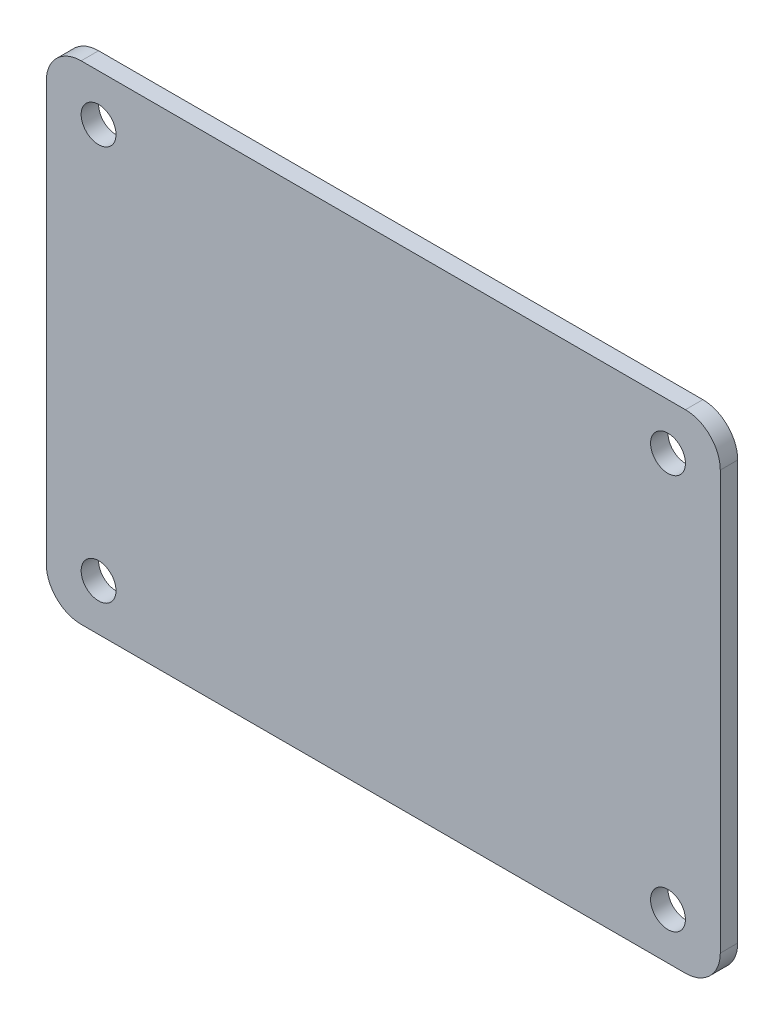
ISO-10303-21;
HEADER;
FILE_DESCRIPTION(('STEP AP214'),'2;1');
FILE_NAME('part.step','',(''),(''),'','','');
FILE_SCHEMA(('AUTOMOTIVE_DESIGN { 1 0 10303 214 1 1 1 1 }'));
ENDSEC;
DATA;
#1=APPLICATION_CONTEXT('core data for automotive mechanical design processes');
#2=APPLICATION_PROTOCOL_DEFINITION('international standard','automotive_design',2000,#1);
#3=PRODUCT_CONTEXT('',#1,'mechanical');
#4=PRODUCT('Part','Part','',(#3));
#5=PRODUCT_RELATED_PRODUCT_CATEGORY('part','',(#4));
#6=PRODUCT_DEFINITION_FORMATION('','',#4);
#7=PRODUCT_DEFINITION_CONTEXT('part definition',#1,'design');
#8=PRODUCT_DEFINITION('design','',#6,#7);
#9=PRODUCT_DEFINITION_SHAPE('','',#8);
#10=(LENGTH_UNIT() NAMED_UNIT(*) SI_UNIT(.MILLI.,.METRE.));
#11=(NAMED_UNIT(*) PLANE_ANGLE_UNIT() SI_UNIT($,.RADIAN.));
#12=(NAMED_UNIT(*) SI_UNIT($,.STERADIAN.) SOLID_ANGLE_UNIT());
#13=UNCERTAINTY_MEASURE_WITH_UNIT(LENGTH_MEASURE(1.E-05),#10,'distance_accuracy_value','');
#14=(GEOMETRIC_REPRESENTATION_CONTEXT(3) GLOBAL_UNCERTAINTY_ASSIGNED_CONTEXT((#13)) GLOBAL_UNIT_ASSIGNED_CONTEXT((#10,
#11,#12)) REPRESENTATION_CONTEXT('',''));
#15=CARTESIAN_POINT('',(0.,0.,0.));
#16=DIRECTION('',(0.,0.,1.));
#17=DIRECTION('',(1.,0.,0.));
#18=AXIS2_PLACEMENT_3D('',#15,#16,#17);
#19=CARTESIAN_POINT('',(29.,21.,1.5));
#20=DIRECTION('',(-1.,0.,0.));
#21=DIRECTION('',(0.,-1.,0.));
#22=AXIS2_PLACEMENT_3D('',#19,#20,#21);
#23=PLANE('',#22);
#24=DIRECTION('',(0.,1.,0.));
#25=VECTOR('',#24,1.);
#26=CARTESIAN_POINT('',(29.,21.,0.));
#27=LINE('',#26,#25);
#28=CARTESIAN_POINT('',(29.,-18.,0.));
#29=VERTEX_POINT('',#28);
#30=CARTESIAN_POINT('',(29.,18.,0.));
#31=VERTEX_POINT('',#30);
#32=EDGE_CURVE('E127',#29,#31,#27,.T.);
#33=ORIENTED_EDGE('',*,*,#32,.T.);
#34=DIRECTION('',(0.,0.,-1.));
#35=VECTOR('',#34,1.);
#36=CARTESIAN_POINT('',(29.,18.,1.5));
#37=LINE('',#36,#35);
#38=CARTESIAN_POINT('',(29.,18.,1.5));
#39=VERTEX_POINT('',#38);
#40=EDGE_CURVE('E105',#31,#39,#37,.F.);
#41=ORIENTED_EDGE('',*,*,#40,.T.);
#42=DIRECTION('',(0.,1.,0.));
#43=VECTOR('',#42,1.);
#44=CARTESIAN_POINT('',(29.,21.,1.5));
#45=LINE('',#44,#43);
#46=CARTESIAN_POINT('',(29.,-18.,1.5));
#47=VERTEX_POINT('',#46);
#48=EDGE_CURVE('E137',#47,#39,#45,.T.);
#49=ORIENTED_EDGE('',*,*,#48,.F.);
#50=DIRECTION('',(0.,0.,-1.));
#51=VECTOR('',#50,1.);
#52=CARTESIAN_POINT('',(29.,-18.,1.5));
#53=LINE('',#52,#51);
#54=EDGE_CURVE('E110',#47,#29,#53,.T.);
#55=ORIENTED_EDGE('',*,*,#54,.T.);
#56=EDGE_LOOP('',(#33,#41,#49,#55));
#57=FACE_BOUND('',#56,.T.);
#58=ADVANCED_FACE('F34',(#57),#23,.F.);
#59=CARTESIAN_POINT('',(-29.,21.,1.5));
#60=DIRECTION('',(0.,-1.,0.));
#61=DIRECTION('',(0.,0.,-1.));
#62=AXIS2_PLACEMENT_3D('',#59,#60,#61);
#63=PLANE('',#62);
#64=DIRECTION('',(-1.,0.,0.));
#65=VECTOR('',#64,1.);
#66=CARTESIAN_POINT('',(-29.,21.,1.5));
#67=LINE('',#66,#65);
#68=CARTESIAN_POINT('',(26.,21.,1.5));
#69=VERTEX_POINT('',#68);
#70=CARTESIAN_POINT('',(-26.,21.,1.5));
#71=VERTEX_POINT('',#70);
#72=EDGE_CURVE('E120',#69,#71,#67,.T.);
#73=ORIENTED_EDGE('',*,*,#72,.F.);
#74=DIRECTION('',(0.,0.,-1.));
#75=VECTOR('',#74,1.);
#76=CARTESIAN_POINT('',(26.,21.,1.5));
#77=LINE('',#76,#75);
#78=CARTESIAN_POINT('',(26.,21.,0.));
#79=VERTEX_POINT('',#78);
#80=EDGE_CURVE('E104',#69,#79,#77,.T.);
#81=ORIENTED_EDGE('',*,*,#80,.T.);
#82=DIRECTION('',(-1.,0.,0.));
#83=VECTOR('',#82,1.);
#84=CARTESIAN_POINT('',(-29.,21.,0.));
#85=LINE('',#84,#83);
#86=CARTESIAN_POINT('',(-26.,21.,0.));
#87=VERTEX_POINT('',#86);
#88=EDGE_CURVE('E117',#79,#87,#85,.T.);
#89=ORIENTED_EDGE('',*,*,#88,.T.);
#90=DIRECTION('',(0.,0.,-1.));
#91=VECTOR('',#90,1.);
#92=CARTESIAN_POINT('',(-26.,21.,1.5));
#93=LINE('',#92,#91);
#94=EDGE_CURVE('E122',#87,#71,#93,.F.);
#95=ORIENTED_EDGE('',*,*,#94,.T.);
#96=EDGE_LOOP('',(#73,#81,#89,#95));
#97=FACE_BOUND('',#96,.T.);
#98=ADVANCED_FACE('F116',(#97),#63,.F.);
#99=CARTESIAN_POINT('',(-29.,21.,1.5));
#100=DIRECTION('',(1.,0.,0.));
#101=DIRECTION('',(0.,1.,0.));
#102=AXIS2_PLACEMENT_3D('',#99,#100,#101);
#103=PLANE('',#102);
#104=DIRECTION('',(0.,-1.,0.));
#105=VECTOR('',#104,1.);
#106=CARTESIAN_POINT('',(-29.,21.,0.));
#107=LINE('',#106,#105);
#108=CARTESIAN_POINT('',(-29.,18.,0.));
#109=VERTEX_POINT('',#108);
#110=CARTESIAN_POINT('',(-29.,-18.,0.));
#111=VERTEX_POINT('',#110);
#112=EDGE_CURVE('E126',#109,#111,#107,.T.);
#113=ORIENTED_EDGE('',*,*,#112,.T.);
#114=DIRECTION('',(0.,0.,-1.));
#115=VECTOR('',#114,1.);
#116=CARTESIAN_POINT('',(-29.,-18.,1.5));
#117=LINE('',#116,#115);
#118=CARTESIAN_POINT('',(-29.,-18.,1.5));
#119=VERTEX_POINT('',#118);
#120=EDGE_CURVE('E11',#111,#119,#117,.F.);
#121=ORIENTED_EDGE('',*,*,#120,.T.);
#122=DIRECTION('',(0.,-1.,0.));
#123=VECTOR('',#122,1.);
#124=CARTESIAN_POINT('',(-29.,21.,1.5));
#125=LINE('',#124,#123);
#126=CARTESIAN_POINT('',(-29.,18.,1.5));
#127=VERTEX_POINT('',#126);
#128=EDGE_CURVE('E163',#127,#119,#125,.T.);
#129=ORIENTED_EDGE('',*,*,#128,.F.);
#130=DIRECTION('',(0.,0.,-1.));
#131=VECTOR('',#130,1.);
#132=CARTESIAN_POINT('',(-29.,18.,1.5));
#133=LINE('',#132,#131);
#134=EDGE_CURVE('E42',#127,#109,#133,.T.);
#135=ORIENTED_EDGE('',*,*,#134,.T.);
#136=EDGE_LOOP('',(#113,#121,#129,#135));
#137=FACE_BOUND('',#136,.T.);
#138=ADVANCED_FACE('F161',(#137),#103,.F.);
#139=CARTESIAN_POINT('',(-29.,-21.,1.5));
#140=DIRECTION('',(0.,1.,0.));
#141=DIRECTION('',(0.,0.,1.));
#142=AXIS2_PLACEMENT_3D('',#139,#140,#141);
#143=PLANE('',#142);
#144=DIRECTION('',(1.,0.,0.));
#145=VECTOR('',#144,1.);
#146=CARTESIAN_POINT('',(-29.,-21.,0.));
#147=LINE('',#146,#145);
#148=CARTESIAN_POINT('',(-26.,-21.,0.));
#149=VERTEX_POINT('',#148);
#150=CARTESIAN_POINT('',(26.,-21.,0.));
#151=VERTEX_POINT('',#150);
#152=EDGE_CURVE('E130',#149,#151,#147,.T.);
#153=ORIENTED_EDGE('',*,*,#152,.T.);
#154=DIRECTION('',(0.,0.,-1.));
#155=VECTOR('',#154,1.);
#156=CARTESIAN_POINT('',(26.,-21.,1.5));
#157=LINE('',#156,#155);
#158=CARTESIAN_POINT('',(26.,-21.,1.5));
#159=VERTEX_POINT('',#158);
#160=EDGE_CURVE('E49',#151,#159,#157,.F.);
#161=ORIENTED_EDGE('',*,*,#160,.T.);
#162=DIRECTION('',(1.,0.,0.));
#163=VECTOR('',#162,1.);
#164=CARTESIAN_POINT('',(-29.,-21.,1.5));
#165=LINE('',#164,#163);
#166=CARTESIAN_POINT('',(-26.,-21.,1.5));
#167=VERTEX_POINT('',#166);
#168=EDGE_CURVE('E138',#167,#159,#165,.T.);
#169=ORIENTED_EDGE('',*,*,#168,.F.);
#170=DIRECTION('',(0.,0.,-1.));
#171=VECTOR('',#170,1.);
#172=CARTESIAN_POINT('',(-26.,-21.,1.5));
#173=LINE('',#172,#171);
#174=EDGE_CURVE('E154',#167,#149,#173,.T.);
#175=ORIENTED_EDGE('',*,*,#174,.T.);
#176=EDGE_LOOP('',(#153,#161,#169,#175));
#177=FACE_BOUND('',#176,.T.);
#178=ADVANCED_FACE('F170',(#177),#143,.F.);
#179=CARTESIAN_POINT('',(0.,0.,1.5));
#180=DIRECTION('',(0.,0.,1.));
#181=DIRECTION('',(1.,0.,0.));
#182=AXIS2_PLACEMENT_3D('',#179,#180,#181);
#183=PLANE('',#182);
#184=CARTESIAN_POINT('',(24.5,17.,1.5));
#185=DIRECTION('',(0.,0.,1.));
#186=DIRECTION('',(1.,0.,0.));
#187=AXIS2_PLACEMENT_3D('',#184,#185,#186);
#188=CIRCLE('',#187,1.5);
#189=CARTESIAN_POINT('',(26.,17.,1.5));
#190=VERTEX_POINT('',#189);
#191=EDGE_CURVE('E183',#190,#190,#188,.T.);
#192=ORIENTED_EDGE('',*,*,#191,.F.);
#193=EDGE_LOOP('',(#192));
#194=FACE_BOUND('',#193,.T.);
#195=CARTESIAN_POINT('',(24.5,-17.,1.5));
#196=DIRECTION('',(0.,0.,1.));
#197=DIRECTION('',(1.,0.,0.));
#198=AXIS2_PLACEMENT_3D('',#195,#196,#197);
#199=CIRCLE('',#198,1.5);
#200=CARTESIAN_POINT('',(26.,-17.,1.5));
#201=VERTEX_POINT('',#200);
#202=EDGE_CURVE('E189',#201,#201,#199,.T.);
#203=ORIENTED_EDGE('',*,*,#202,.F.);
#204=EDGE_LOOP('',(#203));
#205=FACE_BOUND('',#204,.T.);
#206=CARTESIAN_POINT('',(-24.5,-17.,1.5));
#207=DIRECTION('',(0.,0.,1.));
#208=DIRECTION('',(1.,0.,0.));
#209=AXIS2_PLACEMENT_3D('',#206,#207,#208);
#210=CIRCLE('',#209,1.5);
#211=CARTESIAN_POINT('',(-23.,-17.,1.5));
#212=VERTEX_POINT('',#211);
#213=EDGE_CURVE('E195',#212,#212,#210,.T.);
#214=ORIENTED_EDGE('',*,*,#213,.F.);
#215=EDGE_LOOP('',(#214));
#216=FACE_BOUND('',#215,.T.);
#217=CARTESIAN_POINT('',(-24.5,17.,1.5));
#218=DIRECTION('',(0.,0.,1.));
#219=DIRECTION('',(1.,0.,0.));
#220=AXIS2_PLACEMENT_3D('',#217,#218,#219);
#221=CIRCLE('',#220,1.5);
#222=CARTESIAN_POINT('',(-23.,17.,1.5));
#223=VERTEX_POINT('',#222);
#224=EDGE_CURVE('E177',#223,#223,#221,.T.);
#225=ORIENTED_EDGE('',*,*,#224,.F.);
#226=EDGE_LOOP('',(#225));
#227=FACE_BOUND('',#226,.T.);
#228=ORIENTED_EDGE('',*,*,#48,.T.);
#229=CARTESIAN_POINT('',(26.,18.,1.5));
#230=DIRECTION('',(0.,0.,1.));
#231=DIRECTION('',(1.,0.,0.));
#232=AXIS2_PLACEMENT_3D('',#229,#230,#231);
#233=CIRCLE('',#232,3.);
#234=EDGE_CURVE('E152',#39,#69,#233,.T.);
#235=ORIENTED_EDGE('',*,*,#234,.T.);
#236=ORIENTED_EDGE('',*,*,#72,.T.);
#237=CARTESIAN_POINT('',(-26.,18.,1.5));
#238=DIRECTION('',(0.,0.,1.));
#239=DIRECTION('',(1.,0.,0.));
#240=AXIS2_PLACEMENT_3D('',#237,#238,#239);
#241=CIRCLE('',#240,3.);
#242=EDGE_CURVE('E147',#71,#127,#241,.T.);
#243=ORIENTED_EDGE('',*,*,#242,.T.);
#244=ORIENTED_EDGE('',*,*,#128,.T.);
#245=CARTESIAN_POINT('',(-26.,-18.,1.5));
#246=DIRECTION('',(0.,0.,1.));
#247=DIRECTION('',(1.,0.,0.));
#248=AXIS2_PLACEMENT_3D('',#245,#246,#247);
#249=CIRCLE('',#248,3.);
#250=EDGE_CURVE('E56',#119,#167,#249,.T.);
#251=ORIENTED_EDGE('',*,*,#250,.T.);
#252=ORIENTED_EDGE('',*,*,#168,.T.);
#253=CARTESIAN_POINT('',(26.,-18.,1.5));
#254=DIRECTION('',(0.,0.,1.));
#255=DIRECTION('',(1.,0.,0.));
#256=AXIS2_PLACEMENT_3D('',#253,#254,#255);
#257=CIRCLE('',#256,3.);
#258=EDGE_CURVE('E150',#159,#47,#257,.T.);
#259=ORIENTED_EDGE('',*,*,#258,.T.);
#260=EDGE_LOOP('',(#228,#235,#236,#243,#244,#251,#252,#259));
#261=FACE_BOUND('',#260,.T.);
#262=ADVANCED_FACE('F211',(#194,#205,#216,#227,#261),#183,.T.);
#263=CARTESIAN_POINT('',(0.,0.,0.));
#264=DIRECTION('',(0.,0.,1.));
#265=DIRECTION('',(1.,0.,0.));
#266=AXIS2_PLACEMENT_3D('',#263,#264,#265);
#267=PLANE('',#266);
#268=CARTESIAN_POINT('',(24.5,17.,0.));
#269=DIRECTION('',(0.,0.,1.));
#270=DIRECTION('',(1.,0.,0.));
#271=AXIS2_PLACEMENT_3D('',#268,#269,#270);
#272=CIRCLE('',#271,1.5);
#273=CARTESIAN_POINT('',(26.,17.,0.));
#274=VERTEX_POINT('',#273);
#275=EDGE_CURVE('E186',#274,#274,#272,.T.);
#276=ORIENTED_EDGE('',*,*,#275,.T.);
#277=EDGE_LOOP('',(#276));
#278=FACE_BOUND('',#277,.T.);
#279=CARTESIAN_POINT('',(24.5,-17.,0.));
#280=DIRECTION('',(0.,0.,1.));
#281=DIRECTION('',(1.,0.,0.));
#282=AXIS2_PLACEMENT_3D('',#279,#280,#281);
#283=CIRCLE('',#282,1.5);
#284=CARTESIAN_POINT('',(26.,-17.,0.));
#285=VERTEX_POINT('',#284);
#286=EDGE_CURVE('E192',#285,#285,#283,.T.);
#287=ORIENTED_EDGE('',*,*,#286,.T.);
#288=EDGE_LOOP('',(#287));
#289=FACE_BOUND('',#288,.T.);
#290=CARTESIAN_POINT('',(-24.5,-17.,0.));
#291=DIRECTION('',(0.,0.,1.));
#292=DIRECTION('',(1.,0.,0.));
#293=AXIS2_PLACEMENT_3D('',#290,#291,#292);
#294=CIRCLE('',#293,1.5);
#295=CARTESIAN_POINT('',(-23.,-17.,0.));
#296=VERTEX_POINT('',#295);
#297=EDGE_CURVE('E180',#296,#296,#294,.T.);
#298=ORIENTED_EDGE('',*,*,#297,.T.);
#299=EDGE_LOOP('',(#298));
#300=FACE_BOUND('',#299,.T.);
#301=CARTESIAN_POINT('',(-24.5,17.,0.));
#302=DIRECTION('',(0.,0.,1.));
#303=DIRECTION('',(1.,0.,0.));
#304=AXIS2_PLACEMENT_3D('',#301,#302,#303);
#305=CIRCLE('',#304,1.5);
#306=CARTESIAN_POINT('',(-23.,17.,0.));
#307=VERTEX_POINT('',#306);
#308=EDGE_CURVE('E132',#307,#307,#305,.T.);
#309=ORIENTED_EDGE('',*,*,#308,.T.);
#310=EDGE_LOOP('',(#309));
#311=FACE_BOUND('',#310,.T.);
#312=ORIENTED_EDGE('',*,*,#88,.F.);
#313=CARTESIAN_POINT('',(26.,18.,0.));
#314=DIRECTION('',(0.,0.,1.));
#315=DIRECTION('',(1.,0.,0.));
#316=AXIS2_PLACEMENT_3D('',#313,#314,#315);
#317=CIRCLE('',#316,3.);
#318=EDGE_CURVE('E100',#79,#31,#317,.F.);
#319=ORIENTED_EDGE('',*,*,#318,.T.);
#320=ORIENTED_EDGE('',*,*,#32,.F.);
#321=CARTESIAN_POINT('',(26.,-18.,0.));
#322=DIRECTION('',(0.,0.,1.));
#323=DIRECTION('',(1.,0.,0.));
#324=AXIS2_PLACEMENT_3D('',#321,#322,#323);
#325=CIRCLE('',#324,3.);
#326=EDGE_CURVE('E111',#29,#151,#325,.F.);
#327=ORIENTED_EDGE('',*,*,#326,.T.);
#328=ORIENTED_EDGE('',*,*,#152,.F.);
#329=CARTESIAN_POINT('',(-26.,-18.,0.));
#330=DIRECTION('',(0.,0.,1.));
#331=DIRECTION('',(1.,0.,0.));
#332=AXIS2_PLACEMENT_3D('',#329,#330,#331);
#333=CIRCLE('',#332,3.);
#334=EDGE_CURVE('E141',#149,#111,#333,.F.);
#335=ORIENTED_EDGE('',*,*,#334,.T.);
#336=ORIENTED_EDGE('',*,*,#112,.F.);
#337=CARTESIAN_POINT('',(-26.,18.,0.));
#338=DIRECTION('',(0.,0.,1.));
#339=DIRECTION('',(1.,0.,0.));
#340=AXIS2_PLACEMENT_3D('',#337,#338,#339);
#341=CIRCLE('',#340,3.);
#342=EDGE_CURVE('E121',#109,#87,#341,.F.);
#343=ORIENTED_EDGE('',*,*,#342,.T.);
#344=EDGE_LOOP('',(#312,#319,#320,#327,#328,#335,#336,#343));
#345=FACE_BOUND('',#344,.T.);
#346=ADVANCED_FACE('F124',(#278,#289,#300,#311,#345),#267,.F.);
#347=CARTESIAN_POINT('',(-24.5,17.,0.));
#348=DIRECTION('',(0.,0.,1.));
#349=DIRECTION('',(1.,0.,0.));
#350=AXIS2_PLACEMENT_3D('',#347,#348,#349);
#351=CYLINDRICAL_SURFACE('',#350,1.5);
#352=ORIENTED_EDGE('',*,*,#308,.F.);
#353=EDGE_LOOP('',(#352));
#354=FACE_BOUND('',#353,.T.);
#355=ORIENTED_EDGE('',*,*,#224,.T.);
#356=EDGE_LOOP('',(#355));
#357=FACE_BOUND('',#356,.T.);
#358=ADVANCED_FACE('F207',(#354,#357),#351,.F.);
#359=CARTESIAN_POINT('',(-24.5,-17.,0.));
#360=DIRECTION('',(0.,0.,1.));
#361=DIRECTION('',(1.,0.,0.));
#362=AXIS2_PLACEMENT_3D('',#359,#360,#361);
#363=CYLINDRICAL_SURFACE('',#362,1.5);
#364=ORIENTED_EDGE('',*,*,#297,.F.);
#365=EDGE_LOOP('',(#364));
#366=FACE_BOUND('',#365,.T.);
#367=ORIENTED_EDGE('',*,*,#213,.T.);
#368=EDGE_LOOP('',(#367));
#369=FACE_BOUND('',#368,.T.);
#370=ADVANCED_FACE('F203',(#366,#369),#363,.F.);
#371=CARTESIAN_POINT('',(24.5,-17.,0.));
#372=DIRECTION('',(0.,0.,1.));
#373=DIRECTION('',(1.,0.,0.));
#374=AXIS2_PLACEMENT_3D('',#371,#372,#373);
#375=CYLINDRICAL_SURFACE('',#374,1.5);
#376=ORIENTED_EDGE('',*,*,#286,.F.);
#377=EDGE_LOOP('',(#376));
#378=FACE_BOUND('',#377,.T.);
#379=ORIENTED_EDGE('',*,*,#202,.T.);
#380=EDGE_LOOP('',(#379));
#381=FACE_BOUND('',#380,.T.);
#382=ADVANCED_FACE('F206',(#378,#381),#375,.F.);
#383=CARTESIAN_POINT('',(24.5,17.,0.));
#384=DIRECTION('',(0.,0.,1.));
#385=DIRECTION('',(1.,0.,0.));
#386=AXIS2_PLACEMENT_3D('',#383,#384,#385);
#387=CYLINDRICAL_SURFACE('',#386,1.5);
#388=ORIENTED_EDGE('',*,*,#275,.F.);
#389=EDGE_LOOP('',(#388));
#390=FACE_BOUND('',#389,.T.);
#391=ORIENTED_EDGE('',*,*,#191,.T.);
#392=EDGE_LOOP('',(#391));
#393=FACE_BOUND('',#392,.T.);
#394=ADVANCED_FACE('F228',(#390,#393),#387,.F.);
#395=CARTESIAN_POINT('',(26.,18.,1.5));
#396=DIRECTION('',(0.,0.,-1.));
#397=DIRECTION('',(-1.,0.,0.));
#398=AXIS2_PLACEMENT_3D('',#395,#396,#397);
#399=CYLINDRICAL_SURFACE('',#398,3.);
#400=ORIENTED_EDGE('',*,*,#234,.F.);
#401=ORIENTED_EDGE('',*,*,#40,.F.);
#402=ORIENTED_EDGE('',*,*,#318,.F.);
#403=ORIENTED_EDGE('',*,*,#80,.F.);
#404=EDGE_LOOP('',(#400,#401,#402,#403));
#405=FACE_BOUND('',#404,.T.);
#406=ADVANCED_FACE('F103',(#405),#399,.T.);
#407=CARTESIAN_POINT('',(26.,-18.,1.5));
#408=DIRECTION('',(0.,0.,-1.));
#409=DIRECTION('',(-1.,0.,0.));
#410=AXIS2_PLACEMENT_3D('',#407,#408,#409);
#411=CYLINDRICAL_SURFACE('',#410,3.);
#412=ORIENTED_EDGE('',*,*,#258,.F.);
#413=ORIENTED_EDGE('',*,*,#160,.F.);
#414=ORIENTED_EDGE('',*,*,#326,.F.);
#415=ORIENTED_EDGE('',*,*,#54,.F.);
#416=EDGE_LOOP('',(#412,#413,#414,#415));
#417=FACE_BOUND('',#416,.T.);
#418=ADVANCED_FACE('F221',(#417),#411,.T.);
#419=CARTESIAN_POINT('',(-26.,-18.,1.5));
#420=DIRECTION('',(0.,0.,-1.));
#421=DIRECTION('',(-1.,0.,0.));
#422=AXIS2_PLACEMENT_3D('',#419,#420,#421);
#423=CYLINDRICAL_SURFACE('',#422,3.);
#424=ORIENTED_EDGE('',*,*,#250,.F.);
#425=ORIENTED_EDGE('',*,*,#120,.F.);
#426=ORIENTED_EDGE('',*,*,#334,.F.);
#427=ORIENTED_EDGE('',*,*,#174,.F.);
#428=EDGE_LOOP('',(#424,#425,#426,#427));
#429=FACE_BOUND('',#428,.T.);
#430=ADVANCED_FACE('F169',(#429),#423,.T.);
#431=CARTESIAN_POINT('',(-26.,18.,1.5));
#432=DIRECTION('',(0.,0.,-1.));
#433=DIRECTION('',(-1.,0.,0.));
#434=AXIS2_PLACEMENT_3D('',#431,#432,#433);
#435=CYLINDRICAL_SURFACE('',#434,3.);
#436=ORIENTED_EDGE('',*,*,#242,.F.);
#437=ORIENTED_EDGE('',*,*,#94,.F.);
#438=ORIENTED_EDGE('',*,*,#342,.F.);
#439=ORIENTED_EDGE('',*,*,#134,.F.);
#440=EDGE_LOOP('',(#436,#437,#438,#439));
#441=FACE_BOUND('',#440,.T.);
#442=ADVANCED_FACE('F36',(#441),#435,.T.);
#443=CLOSED_SHELL('',(#58,#98,#138,#178,#262,#346,#358,#370,#382,#394,#406,#418,#430,#442));
#444=MANIFOLD_SOLID_BREP('B2',#443);
#445=ADVANCED_BREP_SHAPE_REPRESENTATION('',(#18,#444),#14);
#446=SHAPE_DEFINITION_REPRESENTATION(#9,#445);
ENDSEC;
END-ISO-10303-21;
